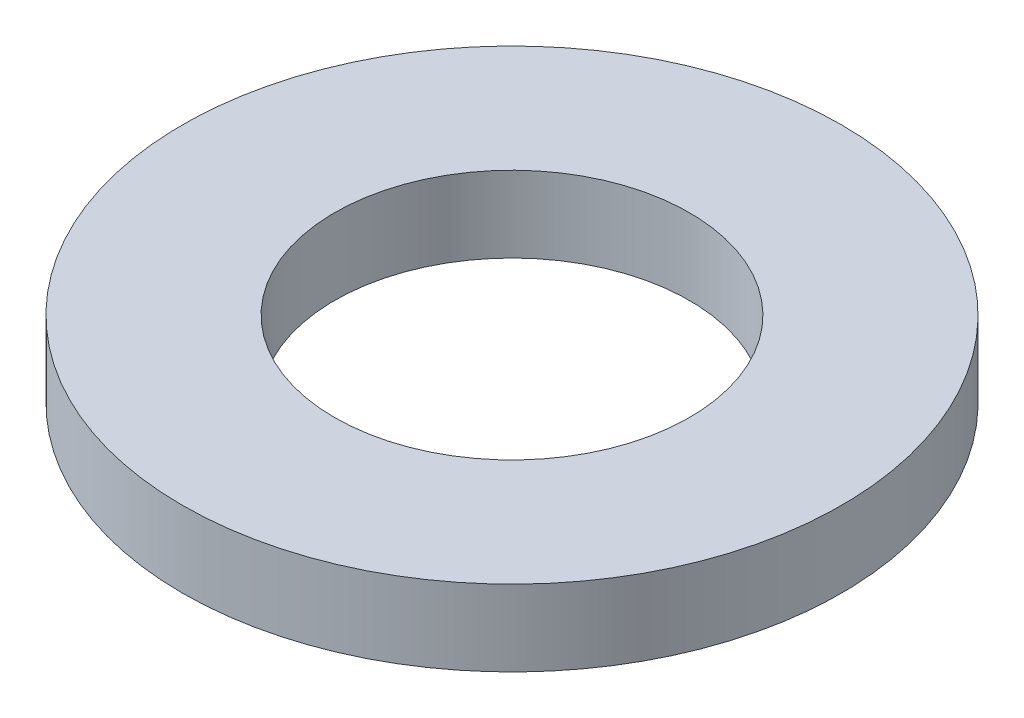
ISO-10303-21;
HEADER;
FILE_DESCRIPTION(('STEP AP214'),'2;1');
FILE_NAME('part.step','',(''),(''),'','','');
FILE_SCHEMA(('AUTOMOTIVE_DESIGN { 1 0 10303 214 1 1 1 1 }'));
ENDSEC;
DATA;
#1=APPLICATION_CONTEXT('core data for automotive mechanical design processes');
#2=APPLICATION_PROTOCOL_DEFINITION('international standard','automotive_design',2000,#1);
#3=PRODUCT_CONTEXT('',#1,'mechanical');
#4=PRODUCT('Part','Part','',(#3));
#5=PRODUCT_RELATED_PRODUCT_CATEGORY('part','',(#4));
#6=PRODUCT_DEFINITION_FORMATION('','',#4);
#7=PRODUCT_DEFINITION_CONTEXT('part definition',#1,'design');
#8=PRODUCT_DEFINITION('design','',#6,#7);
#9=PRODUCT_DEFINITION_SHAPE('','',#8);
#10=(LENGTH_UNIT() NAMED_UNIT(*) SI_UNIT(.MILLI.,.METRE.));
#11=(NAMED_UNIT(*) PLANE_ANGLE_UNIT() SI_UNIT($,.RADIAN.));
#12=(NAMED_UNIT(*) SI_UNIT($,.STERADIAN.) SOLID_ANGLE_UNIT());
#13=UNCERTAINTY_MEASURE_WITH_UNIT(LENGTH_MEASURE(1.E-05),#10,'distance_accuracy_value','');
#14=(GEOMETRIC_REPRESENTATION_CONTEXT(3) GLOBAL_UNCERTAINTY_ASSIGNED_CONTEXT((#13)) GLOBAL_UNIT_ASSIGNED_CONTEXT((#10,
#11,#12)) REPRESENTATION_CONTEXT('',''));
#15=CARTESIAN_POINT('',(0.,0.,0.));
#16=DIRECTION('',(0.,0.,1.));
#17=DIRECTION('',(1.,0.,0.));
#18=AXIS2_PLACEMENT_3D('',#15,#16,#17);
#19=CARTESIAN_POINT('',(0.,15.,0.));
#20=DIRECTION('',(0.,-1.,0.));
#21=DIRECTION('',(0.,0.,-1.));
#22=AXIS2_PLACEMENT_3D('',#19,#20,#21);
#23=CYLINDRICAL_SURFACE('',#22,65.);
#24=CARTESIAN_POINT('',(0.,15.,0.));
#25=DIRECTION('',(0.,1.,0.));
#26=DIRECTION('',(0.,0.,1.));
#27=AXIS2_PLACEMENT_3D('',#24,#25,#26);
#28=CIRCLE('',#27,65.);
#29=CARTESIAN_POINT('',(0.,15.,65.));
#30=VERTEX_POINT('',#29);
#31=EDGE_CURVE('E10',#30,#30,#28,.T.);
#32=ORIENTED_EDGE('',*,*,#31,.F.);
#33=EDGE_LOOP('',(#32));
#34=FACE_BOUND('',#33,.T.);
#35=CARTESIAN_POINT('',(0.,0.,0.));
#36=DIRECTION('',(0.,1.,0.));
#37=DIRECTION('',(0.,0.,1.));
#38=AXIS2_PLACEMENT_3D('',#35,#36,#37);
#39=CIRCLE('',#38,65.);
#40=CARTESIAN_POINT('',(0.,0.,65.));
#41=VERTEX_POINT('',#40);
#42=EDGE_CURVE('E37',#41,#41,#39,.T.);
#43=ORIENTED_EDGE('',*,*,#42,.T.);
#44=EDGE_LOOP('',(#43));
#45=FACE_BOUND('',#44,.T.);
#46=ADVANCED_FACE('F40',(#34,#45),#23,.T.);
#47=CARTESIAN_POINT('',(0.,15.,0.));
#48=DIRECTION('',(0.,1.,0.));
#49=DIRECTION('',(0.,0.,1.));
#50=AXIS2_PLACEMENT_3D('',#47,#48,#49);
#51=PLANE('',#50);
#52=CARTESIAN_POINT('',(0.,15.,0.));
#53=DIRECTION('',(0.,1.,0.));
#54=DIRECTION('',(0.,0.,1.));
#55=AXIS2_PLACEMENT_3D('',#52,#53,#54);
#56=CIRCLE('',#55,35.);
#57=CARTESIAN_POINT('',(0.,15.,35.));
#58=VERTEX_POINT('',#57);
#59=EDGE_CURVE('E50',#58,#58,#56,.T.);
#60=ORIENTED_EDGE('',*,*,#59,.F.);
#61=EDGE_LOOP('',(#60));
#62=FACE_BOUND('',#61,.T.);
#63=ORIENTED_EDGE('',*,*,#31,.T.);
#64=EDGE_LOOP('',(#63));
#65=FACE_BOUND('',#64,.T.);
#66=ADVANCED_FACE('F59',(#62,#65),#51,.T.);
#67=CARTESIAN_POINT('',(0.,0.,0.));
#68=DIRECTION('',(0.,1.,0.));
#69=DIRECTION('',(0.,0.,1.));
#70=AXIS2_PLACEMENT_3D('',#67,#68,#69);
#71=PLANE('',#70);
#72=CARTESIAN_POINT('',(0.,0.,0.));
#73=DIRECTION('',(0.,1.,0.));
#74=DIRECTION('',(0.,0.,1.));
#75=AXIS2_PLACEMENT_3D('',#72,#73,#74);
#76=CIRCLE('',#75,35.);
#77=CARTESIAN_POINT('',(0.,0.,35.));
#78=VERTEX_POINT('',#77);
#79=EDGE_CURVE('E47',#78,#78,#76,.T.);
#80=ORIENTED_EDGE('',*,*,#79,.T.);
#81=EDGE_LOOP('',(#80));
#82=FACE_BOUND('',#81,.T.);
#83=ORIENTED_EDGE('',*,*,#42,.F.);
#84=EDGE_LOOP('',(#83));
#85=FACE_BOUND('',#84,.T.);
#86=ADVANCED_FACE('F58',(#82,#85),#71,.F.);
#87=CARTESIAN_POINT('',(0.,15.,0.));
#88=DIRECTION('',(0.,-1.,0.));
#89=DIRECTION('',(0.,0.,-1.));
#90=AXIS2_PLACEMENT_3D('',#87,#88,#89);
#91=CYLINDRICAL_SURFACE('',#90,35.);
#92=ORIENTED_EDGE('',*,*,#59,.T.);
#93=EDGE_LOOP('',(#92));
#94=FACE_BOUND('',#93,.T.);
#95=ORIENTED_EDGE('',*,*,#79,.F.);
#96=EDGE_LOOP('',(#95));
#97=FACE_BOUND('',#96,.T.);
#98=ADVANCED_FACE('F54',(#94,#97),#91,.F.);
#99=CLOSED_SHELL('',(#46,#66,#86,#98));
#100=MANIFOLD_SOLID_BREP('B2',#99);
#101=ADVANCED_BREP_SHAPE_REPRESENTATION('',(#18,#100),#14);
#102=SHAPE_DEFINITION_REPRESENTATION(#9,#101);
ENDSEC;
END-ISO-10303-21;
